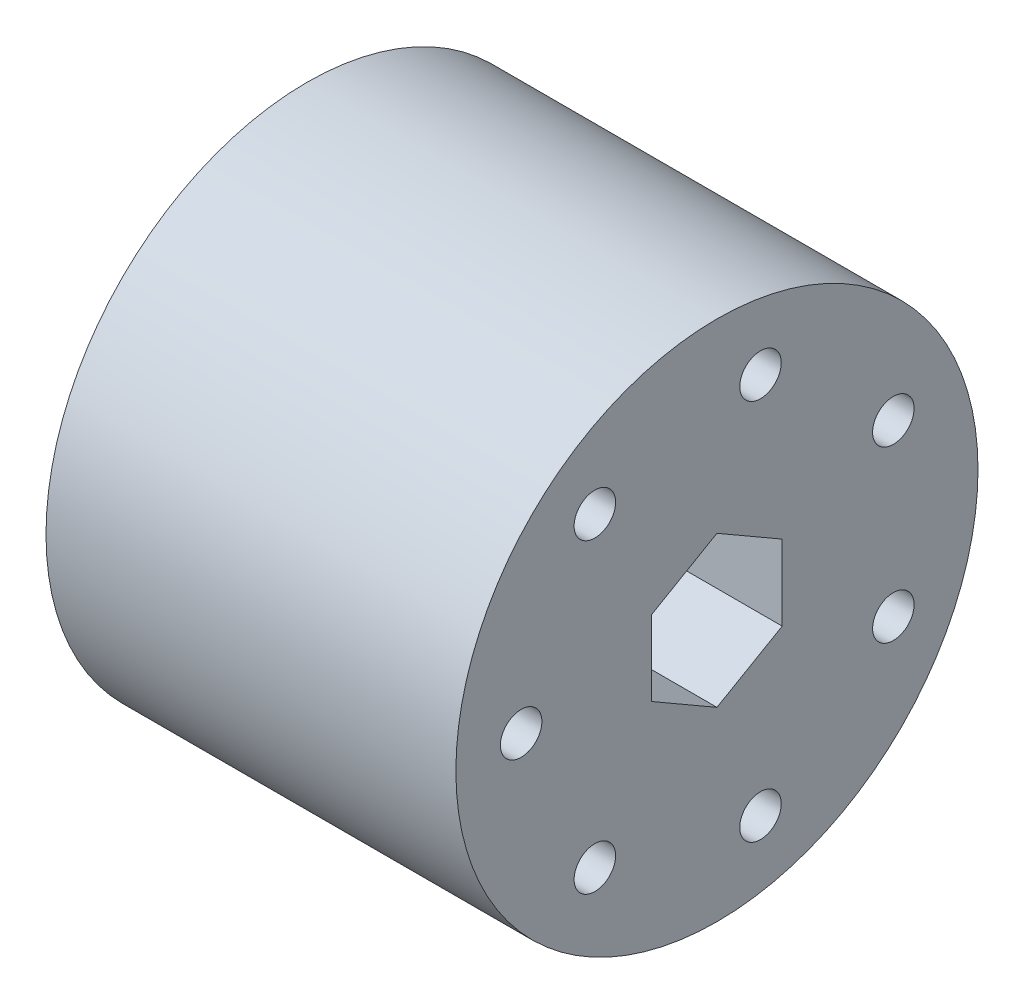
ISO-10303-21;
HEADER;
FILE_DESCRIPTION(('STEP AP214'),'2;1');
FILE_NAME('part.step','',(''),(''),'','','');
FILE_SCHEMA(('AUTOMOTIVE_DESIGN { 1 0 10303 214 1 1 1 1 }'));
ENDSEC;
DATA;
#1=APPLICATION_CONTEXT('core data for automotive mechanical design processes');
#2=APPLICATION_PROTOCOL_DEFINITION('international standard','automotive_design',2000,#1);
#3=PRODUCT_CONTEXT('',#1,'mechanical');
#4=PRODUCT('Part','Part','',(#3));
#5=PRODUCT_RELATED_PRODUCT_CATEGORY('part','',(#4));
#6=PRODUCT_DEFINITION_FORMATION('','',#4);
#7=PRODUCT_DEFINITION_CONTEXT('part definition',#1,'design');
#8=PRODUCT_DEFINITION('design','',#6,#7);
#9=PRODUCT_DEFINITION_SHAPE('','',#8);
#10=(LENGTH_UNIT() NAMED_UNIT(*) SI_UNIT(.MILLI.,.METRE.));
#11=(NAMED_UNIT(*) PLANE_ANGLE_UNIT() SI_UNIT($,.RADIAN.));
#12=(NAMED_UNIT(*) SI_UNIT($,.STERADIAN.) SOLID_ANGLE_UNIT());
#13=UNCERTAINTY_MEASURE_WITH_UNIT(LENGTH_MEASURE(1.E-05),#10,'distance_accuracy_value','');
#14=(GEOMETRIC_REPRESENTATION_CONTEXT(3) GLOBAL_UNCERTAINTY_ASSIGNED_CONTEXT((#13)) GLOBAL_UNIT_ASSIGNED_CONTEXT((#10,
#11,#12)) REPRESENTATION_CONTEXT('',''));
#15=CARTESIAN_POINT('',(0.,0.,0.));
#16=DIRECTION('',(0.,0.,1.));
#17=DIRECTION('',(1.,0.,0.));
#18=AXIS2_PLACEMENT_3D('',#15,#16,#17);
#19=CARTESIAN_POINT('',(39.878,0.,0.));
#20=DIRECTION('',(1.,0.,0.));
#21=DIRECTION('',(0.,0.,-1.));
#22=AXIS2_PLACEMENT_3D('',#19,#20,#21);
#23=PLANE('',#22);
#24=CARTESIAN_POINT('',(39.878,0.,19.05));
#25=DIRECTION('',(1.,0.,0.));
#26=DIRECTION('',(0.,0.,-1.));
#27=AXIS2_PLACEMENT_3D('',#24,#25,#26);
#28=CIRCLE('',#27,2.01929999999999);
#29=CARTESIAN_POINT('',(39.878,0.,17.0307));
#30=VERTEX_POINT('',#29);
#31=EDGE_CURVE('E286',#30,#30,#28,.T.);
#32=ORIENTED_EDGE('',*,*,#31,.F.);
#33=EDGE_LOOP('',(#32));
#34=FACE_BOUND('',#33,.T.);
#35=CARTESIAN_POINT('',(39.878,14.893889741016,11.8774807254088));
#36=DIRECTION('',(1.,0.,0.));
#37=DIRECTION('',(0.,0.,-1.));
#38=AXIS2_PLACEMENT_3D('',#35,#36,#37);
#39=CIRCLE('',#38,2.01929999999999);
#40=CARTESIAN_POINT('',(39.878,14.893889741016,9.85818072540885));
#41=VERTEX_POINT('',#40);
#42=EDGE_CURVE('E288',#41,#41,#39,.T.);
#43=ORIENTED_EDGE('',*,*,#42,.F.);
#44=EDGE_LOOP('',(#43));
#45=FACE_BOUND('',#44,.T.);
#46=CARTESIAN_POINT('',(39.878,18.5723767270637,-4.23902379186786));
#47=DIRECTION('',(1.,0.,0.));
#48=DIRECTION('',(0.,0.,-1.));
#49=AXIS2_PLACEMENT_3D('',#46,#47,#48);
#50=CIRCLE('',#49,2.01929999999999);
#51=CARTESIAN_POINT('',(39.878,18.5723767270637,-6.25832379186785));
#52=VERTEX_POINT('',#51);
#53=EDGE_CURVE('E296',#52,#52,#50,.T.);
#54=ORIENTED_EDGE('',*,*,#53,.F.);
#55=EDGE_LOOP('',(#54));
#56=FACE_BOUND('',#55,.T.);
#57=CARTESIAN_POINT('',(39.878,8.26548523018938,-17.1634569335411));
#58=DIRECTION('',(1.,0.,0.));
#59=DIRECTION('',(0.,0.,-1.));
#60=AXIS2_PLACEMENT_3D('',#57,#58,#59);
#61=CIRCLE('',#60,2.01929999999999);
#62=CARTESIAN_POINT('',(39.878,8.26548523018938,-19.1827569335411));
#63=VERTEX_POINT('',#62);
#64=EDGE_CURVE('E302',#63,#63,#61,.T.);
#65=ORIENTED_EDGE('',*,*,#64,.F.);
#66=EDGE_LOOP('',(#65));
#67=FACE_BOUND('',#66,.T.);
#68=CARTESIAN_POINT('',(39.878,-8.26548523018962,-17.163456933541));
#69=DIRECTION('',(1.,0.,0.));
#70=DIRECTION('',(0.,0.,-1.));
#71=AXIS2_PLACEMENT_3D('',#68,#69,#70);
#72=CIRCLE('',#71,2.01929999999999);
#73=CARTESIAN_POINT('',(39.878,-8.26548523018962,-19.182756933541));
#74=VERTEX_POINT('',#73);
#75=EDGE_CURVE('E308',#74,#74,#72,.T.);
#76=ORIENTED_EDGE('',*,*,#75,.F.);
#77=EDGE_LOOP('',(#76));
#78=FACE_BOUND('',#77,.T.);
#79=CARTESIAN_POINT('',(39.878,-18.5723767270638,-4.23902379186761));
#80=DIRECTION('',(1.,0.,0.));
#81=DIRECTION('',(0.,0.,-1.));
#82=AXIS2_PLACEMENT_3D('',#79,#80,#81);
#83=CIRCLE('',#82,2.01929999999999);
#84=CARTESIAN_POINT('',(39.878,-18.5723767270638,-6.2583237918676));
#85=VERTEX_POINT('',#84);
#86=EDGE_CURVE('E314',#85,#85,#83,.T.);
#87=ORIENTED_EDGE('',*,*,#86,.F.);
#88=EDGE_LOOP('',(#87));
#89=FACE_BOUND('',#88,.T.);
#90=CARTESIAN_POINT('',(39.878,-14.8938897410158,11.8774807254091));
#91=DIRECTION('',(1.,0.,0.));
#92=DIRECTION('',(0.,0.,-1.));
#93=AXIS2_PLACEMENT_3D('',#90,#91,#92);
#94=CIRCLE('',#93,2.01929999999999);
#95=CARTESIAN_POINT('',(39.878,-14.8938897410158,9.85818072540907));
#96=VERTEX_POINT('',#95);
#97=EDGE_CURVE('E320',#96,#96,#94,.T.);
#98=ORIENTED_EDGE('',*,*,#97,.F.);
#99=EDGE_LOOP('',(#98));
#100=FACE_BOUND('',#99,.T.);
#101=CARTESIAN_POINT('',(39.878,0.,0.));
#102=DIRECTION('',(1.,0.,0.));
#103=DIRECTION('',(0.,0.,-1.));
#104=AXIS2_PLACEMENT_3D('',#101,#102,#103);
#105=CIRCLE('',#104,25.4);
#106=CARTESIAN_POINT('',(39.878,0.,-25.4));
#107=VERTEX_POINT('',#106);
#108=EDGE_CURVE('E11',#107,#107,#105,.T.);
#109=ORIENTED_EDGE('',*,*,#108,.T.);
#110=EDGE_LOOP('',(#109));
#111=FACE_BOUND('',#110,.T.);
#112=DIRECTION('',(0.,-1.,0.));
#113=VECTOR('',#112,1.);
#114=CARTESIAN_POINT('',(39.878,3.66617420935412,6.35));
#115=LINE('',#114,#113);
#116=CARTESIAN_POINT('',(39.878,3.66617420935412,6.35));
#117=VERTEX_POINT('',#116);
#118=CARTESIAN_POINT('',(39.878,-3.66617420935413,6.35));
#119=VERTEX_POINT('',#118);
#120=EDGE_CURVE('E100',#117,#119,#115,.T.);
#121=ORIENTED_EDGE('',*,*,#120,.F.);
#122=DIRECTION('',(0.,-0.5,0.866025403784438));
#123=VECTOR('',#122,1.);
#124=CARTESIAN_POINT('',(39.878,7.33234841870824,0.));
#125=LINE('',#124,#123);
#126=CARTESIAN_POINT('',(39.878,7.33234841870824,0.));
#127=VERTEX_POINT('',#126);
#128=EDGE_CURVE('E92',#127,#117,#125,.T.);
#129=ORIENTED_EDGE('',*,*,#128,.F.);
#130=DIRECTION('',(0.,0.5,0.866025403784438));
#131=VECTOR('',#130,1.);
#132=CARTESIAN_POINT('',(39.878,3.66617420935412,-6.35));
#133=LINE('',#132,#131);
#134=CARTESIAN_POINT('',(39.878,3.66617420935412,-6.35));
#135=VERTEX_POINT('',#134);
#136=EDGE_CURVE('E121',#135,#127,#133,.T.);
#137=ORIENTED_EDGE('',*,*,#136,.F.);
#138=DIRECTION('',(0.,1.,0.));
#139=VECTOR('',#138,1.);
#140=CARTESIAN_POINT('',(39.878,-3.66617420935412,-6.35));
#141=LINE('',#140,#139);
#142=CARTESIAN_POINT('',(39.878,-3.66617420935412,-6.35));
#143=VERTEX_POINT('',#142);
#144=EDGE_CURVE('E119',#143,#135,#141,.T.);
#145=ORIENTED_EDGE('',*,*,#144,.F.);
#146=DIRECTION('',(0.,0.5,-0.866025403784439));
#147=VECTOR('',#146,1.);
#148=CARTESIAN_POINT('',(39.878,-7.33234841870825,0.));
#149=LINE('',#148,#147);
#150=CARTESIAN_POINT('',(39.878,-7.33234841870825,0.));
#151=VERTEX_POINT('',#150);
#152=EDGE_CURVE('E114',#151,#143,#149,.T.);
#153=ORIENTED_EDGE('',*,*,#152,.F.);
#154=DIRECTION('',(0.,-0.5,-0.866025403784439));
#155=VECTOR('',#154,1.);
#156=CARTESIAN_POINT('',(39.878,-3.66617420935413,6.35));
#157=LINE('',#156,#155);
#158=EDGE_CURVE('E112',#119,#151,#157,.T.);
#159=ORIENTED_EDGE('',*,*,#158,.F.);
#160=EDGE_LOOP('',(#121,#129,#137,#145,#153,#159));
#161=FACE_BOUND('',#160,.T.);
#162=ADVANCED_FACE('F39',(#34,#45,#56,#67,#78,#89,#100,#111,#161),#23,.T.);
#163=CARTESIAN_POINT('',(0.,0.,0.));
#164=DIRECTION('',(1.,0.,0.));
#165=DIRECTION('',(0.,0.,-1.));
#166=AXIS2_PLACEMENT_3D('',#163,#164,#165);
#167=PLANE('',#166);
#168=CARTESIAN_POINT('',(0.,0.,19.05));
#169=DIRECTION('',(1.,0.,0.));
#170=DIRECTION('',(0.,0.,-1.));
#171=AXIS2_PLACEMENT_3D('',#168,#169,#170);
#172=CIRCLE('',#171,2.01929999999999);
#173=CARTESIAN_POINT('',(0.,0.,17.0307));
#174=VERTEX_POINT('',#173);
#175=EDGE_CURVE('E284',#174,#174,#172,.T.);
#176=ORIENTED_EDGE('',*,*,#175,.T.);
#177=EDGE_LOOP('',(#176));
#178=FACE_BOUND('',#177,.T.);
#179=CARTESIAN_POINT('',(0.,14.893889741016,11.8774807254088));
#180=DIRECTION('',(1.,0.,0.));
#181=DIRECTION('',(0.,0.,-1.));
#182=AXIS2_PLACEMENT_3D('',#179,#180,#181);
#183=CIRCLE('',#182,2.01929999999999);
#184=CARTESIAN_POINT('',(0.,14.893889741016,9.85818072540885));
#185=VERTEX_POINT('',#184);
#186=EDGE_CURVE('E293',#185,#185,#183,.T.);
#187=ORIENTED_EDGE('',*,*,#186,.T.);
#188=EDGE_LOOP('',(#187));
#189=FACE_BOUND('',#188,.T.);
#190=CARTESIAN_POINT('',(0.,18.5723767270637,-4.23902379186786));
#191=DIRECTION('',(1.,0.,0.));
#192=DIRECTION('',(0.,0.,-1.));
#193=AXIS2_PLACEMENT_3D('',#190,#191,#192);
#194=CIRCLE('',#193,2.01929999999999);
#195=CARTESIAN_POINT('',(0.,18.5723767270637,-6.25832379186786));
#196=VERTEX_POINT('',#195);
#197=EDGE_CURVE('E299',#196,#196,#194,.T.);
#198=ORIENTED_EDGE('',*,*,#197,.T.);
#199=EDGE_LOOP('',(#198));
#200=FACE_BOUND('',#199,.T.);
#201=CARTESIAN_POINT('',(0.,8.26548523018938,-17.1634569335411));
#202=DIRECTION('',(1.,0.,0.));
#203=DIRECTION('',(0.,0.,-1.));
#204=AXIS2_PLACEMENT_3D('',#201,#202,#203);
#205=CIRCLE('',#204,2.01929999999999);
#206=CARTESIAN_POINT('',(0.,8.26548523018938,-19.1827569335411));
#207=VERTEX_POINT('',#206);
#208=EDGE_CURVE('E305',#207,#207,#205,.T.);
#209=ORIENTED_EDGE('',*,*,#208,.T.);
#210=EDGE_LOOP('',(#209));
#211=FACE_BOUND('',#210,.T.);
#212=CARTESIAN_POINT('',(0.,-8.26548523018962,-17.163456933541));
#213=DIRECTION('',(1.,0.,0.));
#214=DIRECTION('',(0.,0.,-1.));
#215=AXIS2_PLACEMENT_3D('',#212,#213,#214);
#216=CIRCLE('',#215,2.01929999999999);
#217=CARTESIAN_POINT('',(0.,-8.26548523018962,-19.182756933541));
#218=VERTEX_POINT('',#217);
#219=EDGE_CURVE('E311',#218,#218,#216,.T.);
#220=ORIENTED_EDGE('',*,*,#219,.T.);
#221=EDGE_LOOP('',(#220));
#222=FACE_BOUND('',#221,.T.);
#223=CARTESIAN_POINT('',(0.,-18.5723767270638,-4.23902379186761));
#224=DIRECTION('',(1.,0.,0.));
#225=DIRECTION('',(0.,0.,-1.));
#226=AXIS2_PLACEMENT_3D('',#223,#224,#225);
#227=CIRCLE('',#226,2.01929999999999);
#228=CARTESIAN_POINT('',(0.,-18.5723767270638,-6.25832379186761));
#229=VERTEX_POINT('',#228);
#230=EDGE_CURVE('E317',#229,#229,#227,.T.);
#231=ORIENTED_EDGE('',*,*,#230,.T.);
#232=EDGE_LOOP('',(#231));
#233=FACE_BOUND('',#232,.T.);
#234=CARTESIAN_POINT('',(0.,-14.8938897410158,11.8774807254091));
#235=DIRECTION('',(1.,0.,0.));
#236=DIRECTION('',(0.,0.,-1.));
#237=AXIS2_PLACEMENT_3D('',#234,#235,#236);
#238=CIRCLE('',#237,2.01929999999999);
#239=CARTESIAN_POINT('',(0.,-14.8938897410158,9.85818072540906));
#240=VERTEX_POINT('',#239);
#241=EDGE_CURVE('E124',#240,#240,#238,.T.);
#242=ORIENTED_EDGE('',*,*,#241,.T.);
#243=EDGE_LOOP('',(#242));
#244=FACE_BOUND('',#243,.T.);
#245=CARTESIAN_POINT('',(0.,0.,0.));
#246=DIRECTION('',(1.,0.,0.));
#247=DIRECTION('',(0.,0.,-1.));
#248=AXIS2_PLACEMENT_3D('',#245,#246,#247);
#249=CIRCLE('',#248,25.4);
#250=CARTESIAN_POINT('',(0.,0.,-25.4));
#251=VERTEX_POINT('',#250);
#252=EDGE_CURVE('E43',#251,#251,#249,.T.);
#253=ORIENTED_EDGE('',*,*,#252,.F.);
#254=EDGE_LOOP('',(#253));
#255=FACE_BOUND('',#254,.T.);
#256=DIRECTION('',(0.,-0.5,0.866025403784438));
#257=VECTOR('',#256,1.);
#258=CARTESIAN_POINT('',(0.,7.33234841870824,0.));
#259=LINE('',#258,#257);
#260=CARTESIAN_POINT('',(0.,7.33234841870824,0.));
#261=VERTEX_POINT('',#260);
#262=CARTESIAN_POINT('',(0.,3.66617420935412,6.35));
#263=VERTEX_POINT('',#262);
#264=EDGE_CURVE('E62',#261,#263,#259,.T.);
#265=ORIENTED_EDGE('',*,*,#264,.T.);
#266=DIRECTION('',(0.,-1.,0.));
#267=VECTOR('',#266,1.);
#268=CARTESIAN_POINT('',(0.,3.66617420935412,6.35));
#269=LINE('',#268,#267);
#270=CARTESIAN_POINT('',(0.,-3.66617420935413,6.35));
#271=VERTEX_POINT('',#270);
#272=EDGE_CURVE('E107',#263,#271,#269,.T.);
#273=ORIENTED_EDGE('',*,*,#272,.T.);
#274=DIRECTION('',(0.,-0.5,-0.866025403784439));
#275=VECTOR('',#274,1.);
#276=CARTESIAN_POINT('',(0.,-3.66617420935413,6.35));
#277=LINE('',#276,#275);
#278=CARTESIAN_POINT('',(0.,-7.33234841870825,0.));
#279=VERTEX_POINT('',#278);
#280=EDGE_CURVE('E126',#271,#279,#277,.T.);
#281=ORIENTED_EDGE('',*,*,#280,.T.);
#282=DIRECTION('',(0.,0.5,-0.866025403784439));
#283=VECTOR('',#282,1.);
#284=CARTESIAN_POINT('',(0.,-7.33234841870825,0.));
#285=LINE('',#284,#283);
#286=CARTESIAN_POINT('',(0.,-3.66617420935412,-6.35));
#287=VERTEX_POINT('',#286);
#288=EDGE_CURVE('E129',#279,#287,#285,.T.);
#289=ORIENTED_EDGE('',*,*,#288,.T.);
#290=DIRECTION('',(0.,1.,0.));
#291=VECTOR('',#290,1.);
#292=CARTESIAN_POINT('',(0.,-3.66617420935412,-6.35));
#293=LINE('',#292,#291);
#294=CARTESIAN_POINT('',(0.,3.66617420935412,-6.35));
#295=VERTEX_POINT('',#294);
#296=EDGE_CURVE('E132',#287,#295,#293,.T.);
#297=ORIENTED_EDGE('',*,*,#296,.T.);
#298=DIRECTION('',(0.,0.5,0.866025403784438));
#299=VECTOR('',#298,1.);
#300=CARTESIAN_POINT('',(0.,3.66617420935412,-6.35));
#301=LINE('',#300,#299);
#302=EDGE_CURVE('E101',#295,#261,#301,.T.);
#303=ORIENTED_EDGE('',*,*,#302,.T.);
#304=EDGE_LOOP('',(#265,#273,#281,#289,#297,#303));
#305=FACE_BOUND('',#304,.T.);
#306=ADVANCED_FACE('F149',(#178,#189,#200,#211,#222,#233,#244,#255,#305),#167,.F.);
#307=CARTESIAN_POINT('',(39.878,0.,0.));
#308=DIRECTION('',(-1.,0.,0.));
#309=DIRECTION('',(0.,0.,1.));
#310=AXIS2_PLACEMENT_3D('',#307,#308,#309);
#311=CYLINDRICAL_SURFACE('',#310,25.4);
#312=ORIENTED_EDGE('',*,*,#108,.F.);
#313=EDGE_LOOP('',(#312));
#314=FACE_BOUND('',#313,.T.);
#315=ORIENTED_EDGE('',*,*,#252,.T.);
#316=EDGE_LOOP('',(#315));
#317=FACE_BOUND('',#316,.T.);
#318=ADVANCED_FACE('F41',(#314,#317),#311,.T.);
#319=CARTESIAN_POINT('',(39.878,7.33234841870824,0.));
#320=DIRECTION('',(0.,-0.866025403784439,-0.5));
#321=DIRECTION('',(0.,0.5,-0.866025403784439));
#322=AXIS2_PLACEMENT_3D('',#319,#320,#321);
#323=PLANE('',#322);
#324=ORIENTED_EDGE('',*,*,#264,.F.);
#325=DIRECTION('',(-1.,0.,0.));
#326=VECTOR('',#325,1.);
#327=CARTESIAN_POINT('',(39.878,7.33234841870824,0.));
#328=LINE('',#327,#326);
#329=EDGE_CURVE('E96',#127,#261,#328,.T.);
#330=ORIENTED_EDGE('',*,*,#329,.F.);
#331=ORIENTED_EDGE('',*,*,#128,.T.);
#332=DIRECTION('',(-1.,0.,0.));
#333=VECTOR('',#332,1.);
#334=CARTESIAN_POINT('',(39.878,3.66617420935412,6.35));
#335=LINE('',#334,#333);
#336=EDGE_CURVE('E95',#117,#263,#335,.T.);
#337=ORIENTED_EDGE('',*,*,#336,.T.);
#338=EDGE_LOOP('',(#324,#330,#331,#337));
#339=FACE_BOUND('',#338,.T.);
#340=ADVANCED_FACE('F94',(#339),#323,.T.);
#341=CARTESIAN_POINT('',(39.878,3.66617420935412,6.35));
#342=DIRECTION('',(0.,0.,-1.));
#343=DIRECTION('',(0.,1.,0.));
#344=AXIS2_PLACEMENT_3D('',#341,#342,#343);
#345=PLANE('',#344);
#346=ORIENTED_EDGE('',*,*,#272,.F.);
#347=ORIENTED_EDGE('',*,*,#336,.F.);
#348=ORIENTED_EDGE('',*,*,#120,.T.);
#349=DIRECTION('',(-1.,0.,0.));
#350=VECTOR('',#349,1.);
#351=CARTESIAN_POINT('',(39.878,-3.66617420935413,6.35));
#352=LINE('',#351,#350);
#353=EDGE_CURVE('E108',#119,#271,#352,.T.);
#354=ORIENTED_EDGE('',*,*,#353,.T.);
#355=EDGE_LOOP('',(#346,#347,#348,#354));
#356=FACE_BOUND('',#355,.T.);
#357=ADVANCED_FACE('F104',(#356),#345,.T.);
#358=CARTESIAN_POINT('',(39.878,-3.66617420935413,6.35));
#359=DIRECTION('',(0.,0.866025403784439,-0.5));
#360=DIRECTION('',(0.,0.5,0.866025403784439));
#361=AXIS2_PLACEMENT_3D('',#358,#359,#360);
#362=PLANE('',#361);
#363=ORIENTED_EDGE('',*,*,#280,.F.);
#364=ORIENTED_EDGE('',*,*,#353,.F.);
#365=ORIENTED_EDGE('',*,*,#158,.T.);
#366=DIRECTION('',(-1.,0.,0.));
#367=VECTOR('',#366,1.);
#368=CARTESIAN_POINT('',(39.878,-7.33234841870825,0.));
#369=LINE('',#368,#367);
#370=EDGE_CURVE('E141',#151,#279,#369,.T.);
#371=ORIENTED_EDGE('',*,*,#370,.T.);
#372=EDGE_LOOP('',(#363,#364,#365,#371));
#373=FACE_BOUND('',#372,.T.);
#374=ADVANCED_FACE('F145',(#373),#362,.T.);
#375=CARTESIAN_POINT('',(39.878,-7.33234841870825,0.));
#376=DIRECTION('',(0.,0.866025403784439,0.5));
#377=DIRECTION('',(0.,-0.5,0.866025403784439));
#378=AXIS2_PLACEMENT_3D('',#375,#376,#377);
#379=PLANE('',#378);
#380=ORIENTED_EDGE('',*,*,#288,.F.);
#381=ORIENTED_EDGE('',*,*,#370,.F.);
#382=ORIENTED_EDGE('',*,*,#152,.T.);
#383=DIRECTION('',(-1.,0.,0.));
#384=VECTOR('',#383,1.);
#385=CARTESIAN_POINT('',(39.878,-3.66617420935412,-6.35));
#386=LINE('',#385,#384);
#387=EDGE_CURVE('E139',#143,#287,#386,.T.);
#388=ORIENTED_EDGE('',*,*,#387,.T.);
#389=EDGE_LOOP('',(#380,#381,#382,#388));
#390=FACE_BOUND('',#389,.T.);
#391=ADVANCED_FACE('F157',(#390),#379,.T.);
#392=CARTESIAN_POINT('',(39.878,-3.66617420935412,-6.35));
#393=DIRECTION('',(0.,0.,1.));
#394=DIRECTION('',(1.,0.,0.));
#395=AXIS2_PLACEMENT_3D('',#392,#393,#394);
#396=PLANE('',#395);
#397=ORIENTED_EDGE('',*,*,#296,.F.);
#398=ORIENTED_EDGE('',*,*,#387,.F.);
#399=ORIENTED_EDGE('',*,*,#144,.T.);
#400=DIRECTION('',(-1.,0.,0.));
#401=VECTOR('',#400,1.);
#402=CARTESIAN_POINT('',(39.878,3.66617420935412,-6.35));
#403=LINE('',#402,#401);
#404=EDGE_CURVE('E54',#135,#295,#403,.T.);
#405=ORIENTED_EDGE('',*,*,#404,.T.);
#406=EDGE_LOOP('',(#397,#398,#399,#405));
#407=FACE_BOUND('',#406,.T.);
#408=ADVANCED_FACE('F155',(#407),#396,.T.);
#409=CARTESIAN_POINT('',(39.878,3.66617420935412,-6.35));
#410=DIRECTION('',(0.,-0.866025403784439,0.5));
#411=DIRECTION('',(0.,-0.5,-0.866025403784439));
#412=AXIS2_PLACEMENT_3D('',#409,#410,#411);
#413=PLANE('',#412);
#414=ORIENTED_EDGE('',*,*,#302,.F.);
#415=ORIENTED_EDGE('',*,*,#404,.F.);
#416=ORIENTED_EDGE('',*,*,#136,.T.);
#417=ORIENTED_EDGE('',*,*,#329,.T.);
#418=EDGE_LOOP('',(#414,#415,#416,#417));
#419=FACE_BOUND('',#418,.T.);
#420=ADVANCED_FACE('F151',(#419),#413,.T.);
#421=CARTESIAN_POINT('',(39.878,-14.8938897410158,11.8774807254091));
#422=DIRECTION('',(1.,0.,0.));
#423=DIRECTION('',(0.,0.,-1.));
#424=AXIS2_PLACEMENT_3D('',#421,#422,#423);
#425=CYLINDRICAL_SURFACE('',#424,2.01929999999999);
#426=ORIENTED_EDGE('',*,*,#241,.F.);
#427=EDGE_LOOP('',(#426));
#428=FACE_BOUND('',#427,.T.);
#429=ORIENTED_EDGE('',*,*,#97,.T.);
#430=EDGE_LOOP('',(#429));
#431=FACE_BOUND('',#430,.T.);
#432=ADVANCED_FACE('F209',(#428,#431),#425,.F.);
#433=CARTESIAN_POINT('',(39.878,-18.5723767270638,-4.23902379186761));
#434=DIRECTION('',(1.,0.,0.));
#435=DIRECTION('',(0.,0.,-1.));
#436=AXIS2_PLACEMENT_3D('',#433,#434,#435);
#437=CYLINDRICAL_SURFACE('',#436,2.01929999999999);
#438=ORIENTED_EDGE('',*,*,#230,.F.);
#439=EDGE_LOOP('',(#438));
#440=FACE_BOUND('',#439,.T.);
#441=ORIENTED_EDGE('',*,*,#86,.T.);
#442=EDGE_LOOP('',(#441));
#443=FACE_BOUND('',#442,.T.);
#444=ADVANCED_FACE('F218',(#440,#443),#437,.F.);
#445=CARTESIAN_POINT('',(39.878,-8.26548523018962,-17.163456933541));
#446=DIRECTION('',(1.,0.,0.));
#447=DIRECTION('',(0.,0.,-1.));
#448=AXIS2_PLACEMENT_3D('',#445,#446,#447);
#449=CYLINDRICAL_SURFACE('',#448,2.01929999999999);
#450=ORIENTED_EDGE('',*,*,#219,.F.);
#451=EDGE_LOOP('',(#450));
#452=FACE_BOUND('',#451,.T.);
#453=ORIENTED_EDGE('',*,*,#75,.T.);
#454=EDGE_LOOP('',(#453));
#455=FACE_BOUND('',#454,.T.);
#456=ADVANCED_FACE('F228',(#452,#455),#449,.F.);
#457=CARTESIAN_POINT('',(39.878,8.26548523018938,-17.1634569335411));
#458=DIRECTION('',(1.,0.,0.));
#459=DIRECTION('',(0.,0.,-1.));
#460=AXIS2_PLACEMENT_3D('',#457,#458,#459);
#461=CYLINDRICAL_SURFACE('',#460,2.01929999999999);
#462=ORIENTED_EDGE('',*,*,#208,.F.);
#463=EDGE_LOOP('',(#462));
#464=FACE_BOUND('',#463,.T.);
#465=ORIENTED_EDGE('',*,*,#64,.T.);
#466=EDGE_LOOP('',(#465));
#467=FACE_BOUND('',#466,.T.);
#468=ADVANCED_FACE('F238',(#464,#467),#461,.F.);
#469=CARTESIAN_POINT('',(39.878,18.5723767270637,-4.23902379186786));
#470=DIRECTION('',(1.,0.,0.));
#471=DIRECTION('',(0.,0.,-1.));
#472=AXIS2_PLACEMENT_3D('',#469,#470,#471);
#473=CYLINDRICAL_SURFACE('',#472,2.01929999999999);
#474=ORIENTED_EDGE('',*,*,#197,.F.);
#475=EDGE_LOOP('',(#474));
#476=FACE_BOUND('',#475,.T.);
#477=ORIENTED_EDGE('',*,*,#53,.T.);
#478=EDGE_LOOP('',(#477));
#479=FACE_BOUND('',#478,.T.);
#480=ADVANCED_FACE('F248',(#476,#479),#473,.F.);
#481=CARTESIAN_POINT('',(39.878,14.893889741016,11.8774807254088));
#482=DIRECTION('',(1.,0.,0.));
#483=DIRECTION('',(0.,0.,-1.));
#484=AXIS2_PLACEMENT_3D('',#481,#482,#483);
#485=CYLINDRICAL_SURFACE('',#484,2.01929999999999);
#486=ORIENTED_EDGE('',*,*,#186,.F.);
#487=EDGE_LOOP('',(#486));
#488=FACE_BOUND('',#487,.T.);
#489=ORIENTED_EDGE('',*,*,#42,.T.);
#490=EDGE_LOOP('',(#489));
#491=FACE_BOUND('',#490,.T.);
#492=ADVANCED_FACE('F258',(#488,#491),#485,.F.);
#493=CARTESIAN_POINT('',(39.878,0.,19.05));
#494=DIRECTION('',(1.,0.,0.));
#495=DIRECTION('',(0.,0.,-1.));
#496=AXIS2_PLACEMENT_3D('',#493,#494,#495);
#497=CYLINDRICAL_SURFACE('',#496,2.01929999999999);
#498=ORIENTED_EDGE('',*,*,#175,.F.);
#499=EDGE_LOOP('',(#498));
#500=FACE_BOUND('',#499,.T.);
#501=ORIENTED_EDGE('',*,*,#31,.T.);
#502=EDGE_LOOP('',(#501));
#503=FACE_BOUND('',#502,.T.);
#504=ADVANCED_FACE('F268',(#500,#503),#497,.F.);
#505=CLOSED_SHELL('',(#162,#306,#318,#340,#357,#374,#391,#408,#420,#432,#444,#456,#468,#480,
#492,#504));
#506=MANIFOLD_SOLID_BREP('B2',#505);
#507=ADVANCED_BREP_SHAPE_REPRESENTATION('',(#18,#506),#14);
#508=SHAPE_DEFINITION_REPRESENTATION(#9,#507);
ENDSEC;
END-ISO-10303-21;
